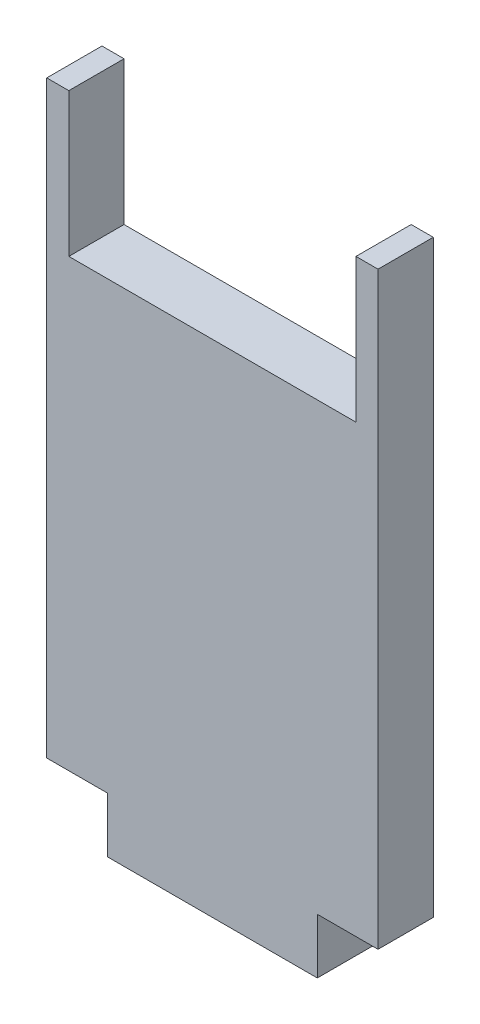
ISO-10303-21;
HEADER;
FILE_DESCRIPTION(('STEP AP214'),'2;1');
FILE_NAME('part.step','',(''),(''),'','','');
FILE_SCHEMA(('AUTOMOTIVE_DESIGN { 1 0 10303 214 1 1 1 1 }'));
ENDSEC;
DATA;
#1=APPLICATION_CONTEXT('core data for automotive mechanical design processes');
#2=APPLICATION_PROTOCOL_DEFINITION('international standard','automotive_design',2000,#1);
#3=PRODUCT_CONTEXT('',#1,'mechanical');
#4=PRODUCT('Part','Part','',(#3));
#5=PRODUCT_RELATED_PRODUCT_CATEGORY('part','',(#4));
#6=PRODUCT_DEFINITION_FORMATION('','',#4);
#7=PRODUCT_DEFINITION_CONTEXT('part definition',#1,'design');
#8=PRODUCT_DEFINITION('design','',#6,#7);
#9=PRODUCT_DEFINITION_SHAPE('','',#8);
#10=(LENGTH_UNIT() NAMED_UNIT(*) SI_UNIT(.MILLI.,.METRE.));
#11=(NAMED_UNIT(*) PLANE_ANGLE_UNIT() SI_UNIT($,.RADIAN.));
#12=(NAMED_UNIT(*) SI_UNIT($,.STERADIAN.) SOLID_ANGLE_UNIT());
#13=UNCERTAINTY_MEASURE_WITH_UNIT(LENGTH_MEASURE(1.E-05),#10,'distance_accuracy_value','');
#14=(GEOMETRIC_REPRESENTATION_CONTEXT(3) GLOBAL_UNCERTAINTY_ASSIGNED_CONTEXT((#13)) GLOBAL_UNIT_ASSIGNED_CONTEXT((#10,
#11,#12)) REPRESENTATION_CONTEXT('',''));
#15=CARTESIAN_POINT('',(0.,0.,0.));
#16=DIRECTION('',(0.,0.,1.));
#17=DIRECTION('',(1.,0.,0.));
#18=AXIS2_PLACEMENT_3D('',#15,#16,#17);
#19=CARTESIAN_POINT('',(0.,0.,0.));
#20=DIRECTION('',(0.,0.,-1.));
#21=DIRECTION('',(-1.,0.,0.));
#22=AXIS2_PLACEMENT_3D('',#19,#20,#21);
#23=PLANE('',#22);
#24=DIRECTION('',(1.,0.,0.));
#25=VECTOR('',#24,1.);
#26=CARTESIAN_POINT('',(9.5,5.,0.));
#27=LINE('',#26,#25);
#28=CARTESIAN_POINT('',(15.,5.,0.));
#29=VERTEX_POINT('',#28);
#30=CARTESIAN_POINT('',(9.5,5.,0.));
#31=VERTEX_POINT('',#30);
#32=EDGE_CURVE('E158',#29,#31,#27,.F.);
#33=ORIENTED_EDGE('',*,*,#32,.T.);
#34=DIRECTION('',(0.,1.,0.));
#35=VECTOR('',#34,1.);
#36=CARTESIAN_POINT('',(9.5,0.,0.));
#37=LINE('',#36,#35);
#38=CARTESIAN_POINT('',(9.5,0.,0.));
#39=VERTEX_POINT('',#38);
#40=EDGE_CURVE('E163',#31,#39,#37,.F.);
#41=ORIENTED_EDGE('',*,*,#40,.T.);
#42=DIRECTION('',(1.,0.,0.));
#43=VECTOR('',#42,1.);
#44=CARTESIAN_POINT('',(9.5,0.,0.));
#45=LINE('',#44,#43);
#46=CARTESIAN_POINT('',(-9.5,0.,0.));
#47=VERTEX_POINT('',#46);
#48=EDGE_CURVE('E105',#39,#47,#45,.F.);
#49=ORIENTED_EDGE('',*,*,#48,.T.);
#50=DIRECTION('',(0.,1.,0.));
#51=VECTOR('',#50,1.);
#52=CARTESIAN_POINT('',(-9.5,0.,0.));
#53=LINE('',#52,#51);
#54=CARTESIAN_POINT('',(-9.5,5.,0.));
#55=VERTEX_POINT('',#54);
#56=EDGE_CURVE('E19',#47,#55,#53,.T.);
#57=ORIENTED_EDGE('',*,*,#56,.T.);
#58=DIRECTION('',(1.,0.,0.));
#59=VECTOR('',#58,1.);
#60=CARTESIAN_POINT('',(-9.5,5.,0.));
#61=LINE('',#60,#59);
#62=CARTESIAN_POINT('',(-15.,5.,0.));
#63=VERTEX_POINT('',#62);
#64=EDGE_CURVE('E102',#55,#63,#61,.F.);
#65=ORIENTED_EDGE('',*,*,#64,.T.);
#66=DIRECTION('',(0.,1.,0.));
#67=VECTOR('',#66,1.);
#68=CARTESIAN_POINT('',(-15.,5.,0.));
#69=LINE('',#68,#67);
#70=CARTESIAN_POINT('',(-15.,58.34,0.));
#71=VERTEX_POINT('',#70);
#72=EDGE_CURVE('E123',#63,#71,#69,.T.);
#73=ORIENTED_EDGE('',*,*,#72,.T.);
#74=DIRECTION('',(1.,0.,0.));
#75=VECTOR('',#74,1.);
#76=CARTESIAN_POINT('',(-15.,58.34,0.));
#77=LINE('',#76,#75);
#78=CARTESIAN_POINT('',(-13.,58.34,0.));
#79=VERTEX_POINT('',#78);
#80=EDGE_CURVE('E128',#71,#79,#77,.T.);
#81=ORIENTED_EDGE('',*,*,#80,.T.);
#82=DIRECTION('',(0.,-1.,0.));
#83=VECTOR('',#82,1.);
#84=CARTESIAN_POINT('',(-13.,58.34,0.));
#85=LINE('',#84,#83);
#86=CARTESIAN_POINT('',(-13.,45.34,0.));
#87=VERTEX_POINT('',#86);
#88=EDGE_CURVE('E133',#79,#87,#85,.T.);
#89=ORIENTED_EDGE('',*,*,#88,.T.);
#90=DIRECTION('',(1.,0.,0.));
#91=VECTOR('',#90,1.);
#92=CARTESIAN_POINT('',(13.,45.34,0.));
#93=LINE('',#92,#91);
#94=CARTESIAN_POINT('',(13.,45.34,0.));
#95=VERTEX_POINT('',#94);
#96=EDGE_CURVE('E138',#87,#95,#93,.T.);
#97=ORIENTED_EDGE('',*,*,#96,.T.);
#98=DIRECTION('',(0.,1.,0.));
#99=VECTOR('',#98,1.);
#100=CARTESIAN_POINT('',(13.,58.34,0.));
#101=LINE('',#100,#99);
#102=CARTESIAN_POINT('',(13.,58.34,0.));
#103=VERTEX_POINT('',#102);
#104=EDGE_CURVE('E143',#95,#103,#101,.T.);
#105=ORIENTED_EDGE('',*,*,#104,.T.);
#106=DIRECTION('',(1.,0.,0.));
#107=VECTOR('',#106,1.);
#108=CARTESIAN_POINT('',(15.,58.34,0.));
#109=LINE('',#108,#107);
#110=CARTESIAN_POINT('',(15.,58.34,0.));
#111=VERTEX_POINT('',#110);
#112=EDGE_CURVE('E148',#103,#111,#109,.T.);
#113=ORIENTED_EDGE('',*,*,#112,.T.);
#114=DIRECTION('',(0.,-1.,0.));
#115=VECTOR('',#114,1.);
#116=CARTESIAN_POINT('',(15.,5.,0.));
#117=LINE('',#116,#115);
#118=EDGE_CURVE('E153',#111,#29,#117,.T.);
#119=ORIENTED_EDGE('',*,*,#118,.T.);
#120=EDGE_LOOP('',(#33,#41,#49,#57,#65,#73,#81,#89,#97,#105,#113,#119));
#121=FACE_BOUND('',#120,.T.);
#122=ADVANCED_FACE('F16',(#121),#23,.T.);
#123=CARTESIAN_POINT('',(-9.5,0.,5.));
#124=DIRECTION('',(1.,0.,0.));
#125=DIRECTION('',(0.,0.,-1.));
#126=AXIS2_PLACEMENT_3D('',#123,#124,#125);
#127=PLANE('',#126);
#128=DIRECTION('',(0.,0.,1.));
#129=VECTOR('',#128,1.);
#130=CARTESIAN_POINT('',(-9.5,0.,5.));
#131=LINE('',#130,#129);
#132=CARTESIAN_POINT('',(-9.5,0.,5.));
#133=VERTEX_POINT('',#132);
#134=EDGE_CURVE('E165',#47,#133,#131,.T.);
#135=ORIENTED_EDGE('',*,*,#134,.T.);
#136=DIRECTION('',(0.,1.,0.));
#137=VECTOR('',#136,1.);
#138=CARTESIAN_POINT('',(-9.5,0.,5.));
#139=LINE('',#138,#137);
#140=CARTESIAN_POINT('',(-9.5,5.,5.));
#141=VERTEX_POINT('',#140);
#142=EDGE_CURVE('E120',#133,#141,#139,.T.);
#143=ORIENTED_EDGE('',*,*,#142,.T.);
#144=DIRECTION('',(0.,0.,1.));
#145=VECTOR('',#144,1.);
#146=CARTESIAN_POINT('',(-9.5,5.,5.));
#147=LINE('',#146,#145);
#148=EDGE_CURVE('E110',#141,#55,#147,.F.);
#149=ORIENTED_EDGE('',*,*,#148,.T.);
#150=ORIENTED_EDGE('',*,*,#56,.F.);
#151=EDGE_LOOP('',(#135,#143,#149,#150));
#152=FACE_BOUND('',#151,.T.);
#153=ADVANCED_FACE('F119',(#152),#127,.F.);
#154=CARTESIAN_POINT('',(-9.5,5.,5.));
#155=DIRECTION('',(0.,1.,0.));
#156=DIRECTION('',(0.,0.,1.));
#157=AXIS2_PLACEMENT_3D('',#154,#155,#156);
#158=PLANE('',#157);
#159=ORIENTED_EDGE('',*,*,#148,.F.);
#160=DIRECTION('',(-1.,0.,0.));
#161=VECTOR('',#160,1.);
#162=CARTESIAN_POINT('',(0.,5.,5.));
#163=LINE('',#162,#161);
#164=CARTESIAN_POINT('',(-15.,5.,5.));
#165=VERTEX_POINT('',#164);
#166=EDGE_CURVE('E170',#141,#165,#163,.T.);
#167=ORIENTED_EDGE('',*,*,#166,.T.);
#168=DIRECTION('',(0.,0.,1.));
#169=VECTOR('',#168,1.);
#170=CARTESIAN_POINT('',(-15.,5.,5.));
#171=LINE('',#170,#169);
#172=EDGE_CURVE('E116',#165,#63,#171,.F.);
#173=ORIENTED_EDGE('',*,*,#172,.T.);
#174=ORIENTED_EDGE('',*,*,#64,.F.);
#175=EDGE_LOOP('',(#159,#167,#173,#174));
#176=FACE_BOUND('',#175,.T.);
#177=ADVANCED_FACE('F113',(#176),#158,.F.);
#178=CARTESIAN_POINT('',(-15.,5.,5.));
#179=DIRECTION('',(1.,0.,0.));
#180=DIRECTION('',(0.,1.,0.));
#181=AXIS2_PLACEMENT_3D('',#178,#179,#180);
#182=PLANE('',#181);
#183=ORIENTED_EDGE('',*,*,#172,.F.);
#184=DIRECTION('',(0.,1.,0.));
#185=VECTOR('',#184,1.);
#186=CARTESIAN_POINT('',(-15.,0.,5.));
#187=LINE('',#186,#185);
#188=CARTESIAN_POINT('',(-15.,58.34,5.));
#189=VERTEX_POINT('',#188);
#190=EDGE_CURVE('E172',#165,#189,#187,.T.);
#191=ORIENTED_EDGE('',*,*,#190,.T.);
#192=DIRECTION('',(0.,0.,1.));
#193=VECTOR('',#192,1.);
#194=CARTESIAN_POINT('',(-15.,58.34,5.));
#195=LINE('',#194,#193);
#196=EDGE_CURVE('E125',#189,#71,#195,.F.);
#197=ORIENTED_EDGE('',*,*,#196,.T.);
#198=ORIENTED_EDGE('',*,*,#72,.F.);
#199=EDGE_LOOP('',(#183,#191,#197,#198));
#200=FACE_BOUND('',#199,.T.);
#201=ADVANCED_FACE('F233',(#200),#182,.F.);
#202=CARTESIAN_POINT('',(-15.,58.34,5.));
#203=DIRECTION('',(0.,-1.,0.));
#204=DIRECTION('',(1.,0.,0.));
#205=AXIS2_PLACEMENT_3D('',#202,#203,#204);
#206=PLANE('',#205);
#207=ORIENTED_EDGE('',*,*,#196,.F.);
#208=DIRECTION('',(-1.,0.,0.));
#209=VECTOR('',#208,1.);
#210=CARTESIAN_POINT('',(0.,58.34,5.));
#211=LINE('',#210,#209);
#212=CARTESIAN_POINT('',(-13.,58.34,5.));
#213=VERTEX_POINT('',#212);
#214=EDGE_CURVE('E175',#189,#213,#211,.F.);
#215=ORIENTED_EDGE('',*,*,#214,.T.);
#216=DIRECTION('',(0.,0.,1.));
#217=VECTOR('',#216,1.);
#218=CARTESIAN_POINT('',(-13.,58.34,5.));
#219=LINE('',#218,#217);
#220=EDGE_CURVE('E130',#213,#79,#219,.F.);
#221=ORIENTED_EDGE('',*,*,#220,.T.);
#222=ORIENTED_EDGE('',*,*,#80,.F.);
#223=EDGE_LOOP('',(#207,#215,#221,#222));
#224=FACE_BOUND('',#223,.T.);
#225=ADVANCED_FACE('F230',(#224),#206,.F.);
#226=CARTESIAN_POINT('',(-13.,58.34,5.));
#227=DIRECTION('',(-1.,0.,0.));
#228=DIRECTION('',(0.,-1.,0.));
#229=AXIS2_PLACEMENT_3D('',#226,#227,#228);
#230=PLANE('',#229);
#231=ORIENTED_EDGE('',*,*,#220,.F.);
#232=DIRECTION('',(0.,1.,0.));
#233=VECTOR('',#232,1.);
#234=CARTESIAN_POINT('',(-13.,0.,5.));
#235=LINE('',#234,#233);
#236=CARTESIAN_POINT('',(-13.,45.34,5.));
#237=VERTEX_POINT('',#236);
#238=EDGE_CURVE('E178',#213,#237,#235,.F.);
#239=ORIENTED_EDGE('',*,*,#238,.T.);
#240=DIRECTION('',(0.,0.,-1.));
#241=VECTOR('',#240,1.);
#242=CARTESIAN_POINT('',(-13.,45.34,5.));
#243=LINE('',#242,#241);
#244=EDGE_CURVE('E135',#237,#87,#243,.T.);
#245=ORIENTED_EDGE('',*,*,#244,.T.);
#246=ORIENTED_EDGE('',*,*,#88,.F.);
#247=EDGE_LOOP('',(#231,#239,#245,#246));
#248=FACE_BOUND('',#247,.T.);
#249=ADVANCED_FACE('F226',(#248),#230,.F.);
#250=CARTESIAN_POINT('',(13.,45.34,5.));
#251=DIRECTION('',(0.,-1.,0.));
#252=DIRECTION('',(0.,0.,-1.));
#253=AXIS2_PLACEMENT_3D('',#250,#251,#252);
#254=PLANE('',#253);
#255=ORIENTED_EDGE('',*,*,#244,.F.);
#256=DIRECTION('',(-1.,0.,0.));
#257=VECTOR('',#256,1.);
#258=CARTESIAN_POINT('',(0.,45.34,5.));
#259=LINE('',#258,#257);
#260=CARTESIAN_POINT('',(13.,45.34,5.));
#261=VERTEX_POINT('',#260);
#262=EDGE_CURVE('E181',#237,#261,#259,.F.);
#263=ORIENTED_EDGE('',*,*,#262,.T.);
#264=DIRECTION('',(0.,0.,1.));
#265=VECTOR('',#264,1.);
#266=CARTESIAN_POINT('',(13.,45.34,5.));
#267=LINE('',#266,#265);
#268=EDGE_CURVE('E140',#261,#95,#267,.F.);
#269=ORIENTED_EDGE('',*,*,#268,.T.);
#270=ORIENTED_EDGE('',*,*,#96,.F.);
#271=EDGE_LOOP('',(#255,#263,#269,#270));
#272=FACE_BOUND('',#271,.T.);
#273=ADVANCED_FACE('F222',(#272),#254,.F.);
#274=CARTESIAN_POINT('',(13.,58.34,5.));
#275=DIRECTION('',(1.,0.,0.));
#276=DIRECTION('',(0.,1.,0.));
#277=AXIS2_PLACEMENT_3D('',#274,#275,#276);
#278=PLANE('',#277);
#279=ORIENTED_EDGE('',*,*,#268,.F.);
#280=DIRECTION('',(0.,1.,0.));
#281=VECTOR('',#280,1.);
#282=CARTESIAN_POINT('',(13.,0.,5.));
#283=LINE('',#282,#281);
#284=CARTESIAN_POINT('',(13.,58.34,5.));
#285=VERTEX_POINT('',#284);
#286=EDGE_CURVE('E184',#261,#285,#283,.T.);
#287=ORIENTED_EDGE('',*,*,#286,.T.);
#288=DIRECTION('',(0.,0.,1.));
#289=VECTOR('',#288,1.);
#290=CARTESIAN_POINT('',(13.,58.34,5.));
#291=LINE('',#290,#289);
#292=EDGE_CURVE('E145',#285,#103,#291,.F.);
#293=ORIENTED_EDGE('',*,*,#292,.T.);
#294=ORIENTED_EDGE('',*,*,#104,.F.);
#295=EDGE_LOOP('',(#279,#287,#293,#294));
#296=FACE_BOUND('',#295,.T.);
#297=ADVANCED_FACE('F218',(#296),#278,.F.);
#298=CARTESIAN_POINT('',(15.,58.34,5.));
#299=DIRECTION('',(0.,-1.,0.));
#300=DIRECTION('',(1.,0.,0.));
#301=AXIS2_PLACEMENT_3D('',#298,#299,#300);
#302=PLANE('',#301);
#303=ORIENTED_EDGE('',*,*,#292,.F.);
#304=DIRECTION('',(-1.,0.,0.));
#305=VECTOR('',#304,1.);
#306=CARTESIAN_POINT('',(0.,58.34,5.));
#307=LINE('',#306,#305);
#308=CARTESIAN_POINT('',(15.,58.34,5.));
#309=VERTEX_POINT('',#308);
#310=EDGE_CURVE('E187',#285,#309,#307,.F.);
#311=ORIENTED_EDGE('',*,*,#310,.T.);
#312=DIRECTION('',(0.,0.,1.));
#313=VECTOR('',#312,1.);
#314=CARTESIAN_POINT('',(15.,58.34,5.));
#315=LINE('',#314,#313);
#316=EDGE_CURVE('E150',#309,#111,#315,.F.);
#317=ORIENTED_EDGE('',*,*,#316,.T.);
#318=ORIENTED_EDGE('',*,*,#112,.F.);
#319=EDGE_LOOP('',(#303,#311,#317,#318));
#320=FACE_BOUND('',#319,.T.);
#321=ADVANCED_FACE('F214',(#320),#302,.F.);
#322=CARTESIAN_POINT('',(15.,5.,5.));
#323=DIRECTION('',(-1.,0.,0.));
#324=DIRECTION('',(0.,-1.,0.));
#325=AXIS2_PLACEMENT_3D('',#322,#323,#324);
#326=PLANE('',#325);
#327=ORIENTED_EDGE('',*,*,#316,.F.);
#328=DIRECTION('',(0.,1.,0.));
#329=VECTOR('',#328,1.);
#330=CARTESIAN_POINT('',(15.,0.,5.));
#331=LINE('',#330,#329);
#332=CARTESIAN_POINT('',(15.,5.,5.));
#333=VERTEX_POINT('',#332);
#334=EDGE_CURVE('E190',#309,#333,#331,.F.);
#335=ORIENTED_EDGE('',*,*,#334,.T.);
#336=DIRECTION('',(0.,0.,1.));
#337=VECTOR('',#336,1.);
#338=CARTESIAN_POINT('',(15.,5.,5.));
#339=LINE('',#338,#337);
#340=EDGE_CURVE('E155',#333,#29,#339,.F.);
#341=ORIENTED_EDGE('',*,*,#340,.T.);
#342=ORIENTED_EDGE('',*,*,#118,.F.);
#343=EDGE_LOOP('',(#327,#335,#341,#342));
#344=FACE_BOUND('',#343,.T.);
#345=ADVANCED_FACE('F210',(#344),#326,.F.);
#346=CARTESIAN_POINT('',(9.5,5.,5.));
#347=DIRECTION('',(0.,1.,0.));
#348=DIRECTION('',(0.,0.,1.));
#349=AXIS2_PLACEMENT_3D('',#346,#347,#348);
#350=PLANE('',#349);
#351=ORIENTED_EDGE('',*,*,#340,.F.);
#352=DIRECTION('',(-1.,0.,0.));
#353=VECTOR('',#352,1.);
#354=CARTESIAN_POINT('',(0.,5.,5.));
#355=LINE('',#354,#353);
#356=CARTESIAN_POINT('',(9.5,5.,5.));
#357=VERTEX_POINT('',#356);
#358=EDGE_CURVE('E193',#333,#357,#355,.T.);
#359=ORIENTED_EDGE('',*,*,#358,.T.);
#360=DIRECTION('',(0.,0.,1.));
#361=VECTOR('',#360,1.);
#362=CARTESIAN_POINT('',(9.5,5.,5.));
#363=LINE('',#362,#361);
#364=EDGE_CURVE('E160',#357,#31,#363,.F.);
#365=ORIENTED_EDGE('',*,*,#364,.T.);
#366=ORIENTED_EDGE('',*,*,#32,.F.);
#367=EDGE_LOOP('',(#351,#359,#365,#366));
#368=FACE_BOUND('',#367,.T.);
#369=ADVANCED_FACE('F206',(#368),#350,.F.);
#370=CARTESIAN_POINT('',(9.5,0.,5.));
#371=DIRECTION('',(-1.,0.,0.));
#372=DIRECTION('',(0.,0.,1.));
#373=AXIS2_PLACEMENT_3D('',#370,#371,#372);
#374=PLANE('',#373);
#375=ORIENTED_EDGE('',*,*,#364,.F.);
#376=DIRECTION('',(0.,1.,0.));
#377=VECTOR('',#376,1.);
#378=CARTESIAN_POINT('',(9.5,0.,5.));
#379=LINE('',#378,#377);
#380=CARTESIAN_POINT('',(9.5,0.,5.));
#381=VERTEX_POINT('',#380);
#382=EDGE_CURVE('E25',#357,#381,#379,.F.);
#383=ORIENTED_EDGE('',*,*,#382,.T.);
#384=DIRECTION('',(0.,0.,1.));
#385=VECTOR('',#384,1.);
#386=CARTESIAN_POINT('',(9.5,0.,5.));
#387=LINE('',#386,#385);
#388=EDGE_CURVE('E33',#381,#39,#387,.F.);
#389=ORIENTED_EDGE('',*,*,#388,.T.);
#390=ORIENTED_EDGE('',*,*,#40,.F.);
#391=EDGE_LOOP('',(#375,#383,#389,#390));
#392=FACE_BOUND('',#391,.T.);
#393=ADVANCED_FACE('F199',(#392),#374,.F.);
#394=CARTESIAN_POINT('',(9.5,0.,5.));
#395=DIRECTION('',(0.,1.,0.));
#396=DIRECTION('',(0.,0.,1.));
#397=AXIS2_PLACEMENT_3D('',#394,#395,#396);
#398=PLANE('',#397);
#399=ORIENTED_EDGE('',*,*,#388,.F.);
#400=DIRECTION('',(-1.,0.,0.));
#401=VECTOR('',#400,1.);
#402=CARTESIAN_POINT('',(0.,0.,5.));
#403=LINE('',#402,#401);
#404=EDGE_CURVE('E11',#381,#133,#403,.T.);
#405=ORIENTED_EDGE('',*,*,#404,.T.);
#406=ORIENTED_EDGE('',*,*,#134,.F.);
#407=ORIENTED_EDGE('',*,*,#48,.F.);
#408=EDGE_LOOP('',(#399,#405,#406,#407));
#409=FACE_BOUND('',#408,.T.);
#410=ADVANCED_FACE('F234',(#409),#398,.F.);
#411=CARTESIAN_POINT('',(0.,0.,5.));
#412=DIRECTION('',(0.,0.,-1.));
#413=DIRECTION('',(-1.,0.,0.));
#414=AXIS2_PLACEMENT_3D('',#411,#412,#413);
#415=PLANE('',#414);
#416=ORIENTED_EDGE('',*,*,#382,.F.);
#417=ORIENTED_EDGE('',*,*,#358,.F.);
#418=ORIENTED_EDGE('',*,*,#334,.F.);
#419=ORIENTED_EDGE('',*,*,#310,.F.);
#420=ORIENTED_EDGE('',*,*,#286,.F.);
#421=ORIENTED_EDGE('',*,*,#262,.F.);
#422=ORIENTED_EDGE('',*,*,#238,.F.);
#423=ORIENTED_EDGE('',*,*,#214,.F.);
#424=ORIENTED_EDGE('',*,*,#190,.F.);
#425=ORIENTED_EDGE('',*,*,#166,.F.);
#426=ORIENTED_EDGE('',*,*,#142,.F.);
#427=ORIENTED_EDGE('',*,*,#404,.F.);
#428=EDGE_LOOP('',(#416,#417,#418,#419,#420,#421,#422,#423,#424,#425,#426,#427));
#429=FACE_BOUND('',#428,.T.);
#430=ADVANCED_FACE('F203',(#429),#415,.F.);
#431=CLOSED_SHELL('',(#122,#153,#177,#201,#225,#249,#273,#297,#321,#345,#369,#393,#410,#430));
#432=MANIFOLD_SOLID_BREP('B1',#431);
#433=ADVANCED_BREP_SHAPE_REPRESENTATION('',(#18,#432),#14);
#434=SHAPE_DEFINITION_REPRESENTATION(#9,#433);
ENDSEC;
END-ISO-10303-21;
